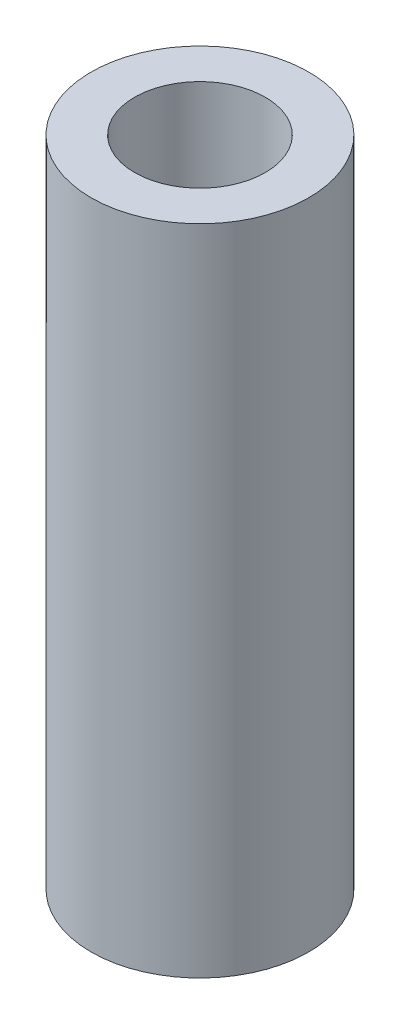
ISO-10303-21;
HEADER;
FILE_DESCRIPTION(('STEP AP214'),'2;1');
FILE_NAME('part.step','',(''),(''),'','','');
FILE_SCHEMA(('AUTOMOTIVE_DESIGN { 1 0 10303 214 1 1 1 1 }'));
ENDSEC;
DATA;
#1=APPLICATION_CONTEXT('core data for automotive mechanical design processes');
#2=APPLICATION_PROTOCOL_DEFINITION('international standard','automotive_design',2000,#1);
#3=PRODUCT_CONTEXT('',#1,'mechanical');
#4=PRODUCT('Part','Part','',(#3));
#5=PRODUCT_RELATED_PRODUCT_CATEGORY('part','',(#4));
#6=PRODUCT_DEFINITION_FORMATION('','',#4);
#7=PRODUCT_DEFINITION_CONTEXT('part definition',#1,'design');
#8=PRODUCT_DEFINITION('design','',#6,#7);
#9=PRODUCT_DEFINITION_SHAPE('','',#8);
#10=(LENGTH_UNIT() NAMED_UNIT(*) SI_UNIT(.MILLI.,.METRE.));
#11=(NAMED_UNIT(*) PLANE_ANGLE_UNIT() SI_UNIT($,.RADIAN.));
#12=(NAMED_UNIT(*) SI_UNIT($,.STERADIAN.) SOLID_ANGLE_UNIT());
#13=UNCERTAINTY_MEASURE_WITH_UNIT(LENGTH_MEASURE(1.E-05),#10,'distance_accuracy_value','');
#14=(GEOMETRIC_REPRESENTATION_CONTEXT(3) GLOBAL_UNCERTAINTY_ASSIGNED_CONTEXT((#13)) GLOBAL_UNIT_ASSIGNED_CONTEXT((#10,
#11,#12)) REPRESENTATION_CONTEXT('',''));
#15=CARTESIAN_POINT('',(0.,0.,0.));
#16=DIRECTION('',(0.,0.,1.));
#17=DIRECTION('',(1.,0.,0.));
#18=AXIS2_PLACEMENT_3D('',#15,#16,#17);
#19=CARTESIAN_POINT('',(0.,15.,0.));
#20=DIRECTION('',(0.,1.,0.));
#21=DIRECTION('',(0.,0.,1.));
#22=AXIS2_PLACEMENT_3D('',#19,#20,#21);
#23=PLANE('',#22);
#24=CARTESIAN_POINT('',(0.,15.,0.));
#25=DIRECTION('',(0.,1.,0.));
#26=DIRECTION('',(0.,0.,1.));
#27=AXIS2_PLACEMENT_3D('',#24,#25,#26);
#28=CIRCLE('',#27,2.5);
#29=CARTESIAN_POINT('',(0.,15.,2.5));
#30=VERTEX_POINT('',#29);
#31=EDGE_CURVE('E10',#30,#30,#28,.T.);
#32=ORIENTED_EDGE('',*,*,#31,.T.);
#33=EDGE_LOOP('',(#32));
#34=FACE_BOUND('',#33,.T.);
#35=CARTESIAN_POINT('',(0.,15.,0.));
#36=DIRECTION('',(0.,1.,0.));
#37=DIRECTION('',(0.,0.,1.));
#38=AXIS2_PLACEMENT_3D('',#35,#36,#37);
#39=CIRCLE('',#38,1.5);
#40=CARTESIAN_POINT('',(0.,15.,1.5));
#41=VERTEX_POINT('',#40);
#42=EDGE_CURVE('E45',#41,#41,#39,.T.);
#43=ORIENTED_EDGE('',*,*,#42,.F.);
#44=EDGE_LOOP('',(#43));
#45=FACE_BOUND('',#44,.T.);
#46=ADVANCED_FACE('F34',(#34,#45),#23,.T.);
#47=CARTESIAN_POINT('',(0.,0.,0.));
#48=DIRECTION('',(0.,1.,0.));
#49=DIRECTION('',(0.,0.,1.));
#50=AXIS2_PLACEMENT_3D('',#47,#48,#49);
#51=PLANE('',#50);
#52=CARTESIAN_POINT('',(0.,0.,0.));
#53=DIRECTION('',(0.,1.,0.));
#54=DIRECTION('',(0.,0.,1.));
#55=AXIS2_PLACEMENT_3D('',#52,#53,#54);
#56=CIRCLE('',#55,2.5);
#57=CARTESIAN_POINT('',(0.,0.,2.5));
#58=VERTEX_POINT('',#57);
#59=EDGE_CURVE('E38',#58,#58,#56,.T.);
#60=ORIENTED_EDGE('',*,*,#59,.F.);
#61=EDGE_LOOP('',(#60));
#62=FACE_BOUND('',#61,.T.);
#63=CARTESIAN_POINT('',(0.,0.,0.));
#64=DIRECTION('',(0.,1.,0.));
#65=DIRECTION('',(0.,0.,1.));
#66=AXIS2_PLACEMENT_3D('',#63,#64,#65);
#67=CIRCLE('',#66,1.5);
#68=CARTESIAN_POINT('',(0.,0.,1.5));
#69=VERTEX_POINT('',#68);
#70=EDGE_CURVE('E47',#69,#69,#67,.T.);
#71=ORIENTED_EDGE('',*,*,#70,.T.);
#72=EDGE_LOOP('',(#71));
#73=FACE_BOUND('',#72,.T.);
#74=ADVANCED_FACE('F57',(#62,#73),#51,.F.);
#75=CARTESIAN_POINT('',(0.,15.,0.));
#76=DIRECTION('',(0.,-1.,0.));
#77=DIRECTION('',(0.,0.,-1.));
#78=AXIS2_PLACEMENT_3D('',#75,#76,#77);
#79=CYLINDRICAL_SURFACE('',#78,2.5);
#80=ORIENTED_EDGE('',*,*,#31,.F.);
#81=EDGE_LOOP('',(#80));
#82=FACE_BOUND('',#81,.T.);
#83=ORIENTED_EDGE('',*,*,#59,.T.);
#84=EDGE_LOOP('',(#83));
#85=FACE_BOUND('',#84,.T.);
#86=ADVANCED_FACE('F36',(#82,#85),#79,.T.);
#87=CARTESIAN_POINT('',(0.,15.,0.));
#88=DIRECTION('',(0.,-1.,0.));
#89=DIRECTION('',(0.,0.,-1.));
#90=AXIS2_PLACEMENT_3D('',#87,#88,#89);
#91=CYLINDRICAL_SURFACE('',#90,1.5);
#92=ORIENTED_EDGE('',*,*,#42,.T.);
#93=EDGE_LOOP('',(#92));
#94=FACE_BOUND('',#93,.T.);
#95=ORIENTED_EDGE('',*,*,#70,.F.);
#96=EDGE_LOOP('',(#95));
#97=FACE_BOUND('',#96,.T.);
#98=ADVANCED_FACE('F53',(#94,#97),#91,.F.);
#99=CLOSED_SHELL('',(#46,#74,#86,#98));
#100=MANIFOLD_SOLID_BREP('B2',#99);
#101=ADVANCED_BREP_SHAPE_REPRESENTATION('',(#18,#100),#14);
#102=SHAPE_DEFINITION_REPRESENTATION(#9,#101);
ENDSEC;
END-ISO-10303-21;
